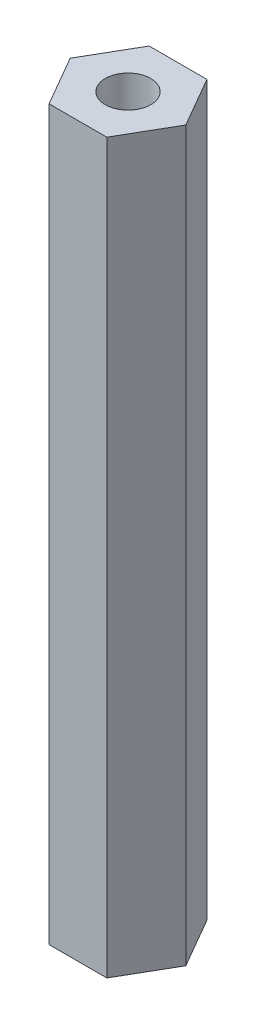
ISO-10303-21;
HEADER;
FILE_DESCRIPTION(('STEP AP214'),'2;1');
FILE_NAME('part.step','',(''),(''),'','','');
FILE_SCHEMA(('AUTOMOTIVE_DESIGN { 1 0 10303 214 1 1 1 1 }'));
ENDSEC;
DATA;
#1=APPLICATION_CONTEXT('core data for automotive mechanical design processes');
#2=APPLICATION_PROTOCOL_DEFINITION('international standard','automotive_design',2000,#1);
#3=PRODUCT_CONTEXT('',#1,'mechanical');
#4=PRODUCT('Part','Part','',(#3));
#5=PRODUCT_RELATED_PRODUCT_CATEGORY('part','',(#4));
#6=PRODUCT_DEFINITION_FORMATION('','',#4);
#7=PRODUCT_DEFINITION_CONTEXT('part definition',#1,'design');
#8=PRODUCT_DEFINITION('design','',#6,#7);
#9=PRODUCT_DEFINITION_SHAPE('','',#8);
#10=(LENGTH_UNIT() NAMED_UNIT(*) SI_UNIT(.MILLI.,.METRE.));
#11=(NAMED_UNIT(*) PLANE_ANGLE_UNIT() SI_UNIT($,.RADIAN.));
#12=(NAMED_UNIT(*) SI_UNIT($,.STERADIAN.) SOLID_ANGLE_UNIT());
#13=UNCERTAINTY_MEASURE_WITH_UNIT(LENGTH_MEASURE(1.E-05),#10,'distance_accuracy_value','');
#14=(GEOMETRIC_REPRESENTATION_CONTEXT(3) GLOBAL_UNCERTAINTY_ASSIGNED_CONTEXT((#13)) GLOBAL_UNIT_ASSIGNED_CONTEXT((#10,
#11,#12)) REPRESENTATION_CONTEXT('',''));
#15=CARTESIAN_POINT('',(0.,0.,0.));
#16=DIRECTION('',(0.,0.,1.));
#17=DIRECTION('',(1.,0.,0.));
#18=AXIS2_PLACEMENT_3D('',#15,#16,#17);
#19=CARTESIAN_POINT('',(1.58771324027148,20.,2.75));
#20=DIRECTION('',(-0.866025403784439,0.,-0.5));
#21=DIRECTION('',(-0.5,0.,0.866025403784439));
#22=AXIS2_PLACEMENT_3D('',#19,#20,#21);
#23=PLANE('',#22);
#24=DIRECTION('',(0.5,0.,-0.866025403784439));
#25=VECTOR('',#24,1.);
#26=CARTESIAN_POINT('',(1.58771324027148,-20.,2.75));
#27=LINE('',#26,#25);
#28=CARTESIAN_POINT('',(1.58771324027148,-20.,2.75));
#29=VERTEX_POINT('',#28);
#30=CARTESIAN_POINT('',(3.17542648054294,-20.,0.));
#31=VERTEX_POINT('',#30);
#32=EDGE_CURVE('E119',#29,#31,#27,.T.);
#33=ORIENTED_EDGE('',*,*,#32,.T.);
#34=DIRECTION('',(0.,-1.,0.));
#35=VECTOR('',#34,1.);
#36=CARTESIAN_POINT('',(3.17542648054294,20.,0.));
#37=LINE('',#36,#35);
#38=CARTESIAN_POINT('',(3.17542648054294,20.,0.));
#39=VERTEX_POINT('',#38);
#40=EDGE_CURVE('E11',#39,#31,#37,.T.);
#41=ORIENTED_EDGE('',*,*,#40,.F.);
#42=DIRECTION('',(0.5,0.,-0.866025403784439));
#43=VECTOR('',#42,1.);
#44=CARTESIAN_POINT('',(1.58771324027148,20.,2.75));
#45=LINE('',#44,#43);
#46=CARTESIAN_POINT('',(1.58771324027148,20.,2.75));
#47=VERTEX_POINT('',#46);
#48=EDGE_CURVE('E130',#47,#39,#45,.T.);
#49=ORIENTED_EDGE('',*,*,#48,.F.);
#50=DIRECTION('',(0.,-1.,0.));
#51=VECTOR('',#50,1.);
#52=CARTESIAN_POINT('',(1.58771324027148,20.,2.75));
#53=LINE('',#52,#51);
#54=EDGE_CURVE('E115',#47,#29,#53,.T.);
#55=ORIENTED_EDGE('',*,*,#54,.T.);
#56=EDGE_LOOP('',(#33,#41,#49,#55));
#57=FACE_BOUND('',#56,.T.);
#58=ADVANCED_FACE('F35',(#57),#23,.F.);
#59=CARTESIAN_POINT('',(3.17542648054294,20.,0.));
#60=DIRECTION('',(-0.866025403784439,0.,0.5));
#61=DIRECTION('',(0.5,0.,0.866025403784439));
#62=AXIS2_PLACEMENT_3D('',#59,#60,#61);
#63=PLANE('',#62);
#64=DIRECTION('',(-0.5,0.,-0.866025403784438));
#65=VECTOR('',#64,1.);
#66=CARTESIAN_POINT('',(3.17542648054294,-20.,0.));
#67=LINE('',#66,#65);
#68=CARTESIAN_POINT('',(1.58771324027146,-20.,-2.75));
#69=VERTEX_POINT('',#68);
#70=EDGE_CURVE('E122',#31,#69,#67,.T.);
#71=ORIENTED_EDGE('',*,*,#70,.T.);
#72=DIRECTION('',(0.,-1.,0.));
#73=VECTOR('',#72,1.);
#74=CARTESIAN_POINT('',(1.58771324027146,20.,-2.75));
#75=LINE('',#74,#73);
#76=CARTESIAN_POINT('',(1.58771324027146,20.,-2.75));
#77=VERTEX_POINT('',#76);
#78=EDGE_CURVE('E43',#77,#69,#75,.T.);
#79=ORIENTED_EDGE('',*,*,#78,.F.);
#80=DIRECTION('',(-0.5,0.,-0.866025403784438));
#81=VECTOR('',#80,1.);
#82=CARTESIAN_POINT('',(3.17542648054294,20.,0.));
#83=LINE('',#82,#81);
#84=EDGE_CURVE('E88',#39,#77,#83,.T.);
#85=ORIENTED_EDGE('',*,*,#84,.F.);
#86=ORIENTED_EDGE('',*,*,#40,.T.);
#87=EDGE_LOOP('',(#71,#79,#85,#86));
#88=FACE_BOUND('',#87,.T.);
#89=ADVANCED_FACE('F155',(#88),#63,.F.);
#90=CARTESIAN_POINT('',(1.58771324027146,20.,-2.75));
#91=DIRECTION('',(0.,0.,1.));
#92=DIRECTION('',(1.,0.,0.));
#93=AXIS2_PLACEMENT_3D('',#90,#91,#92);
#94=PLANE('',#93);
#95=DIRECTION('',(-1.,0.,0.));
#96=VECTOR('',#95,1.);
#97=CARTESIAN_POINT('',(1.58771324027146,-20.,-2.75));
#98=LINE('',#97,#96);
#99=CARTESIAN_POINT('',(-1.58771324027147,-20.,-2.75));
#100=VERTEX_POINT('',#99);
#101=EDGE_CURVE('E125',#69,#100,#98,.T.);
#102=ORIENTED_EDGE('',*,*,#101,.T.);
#103=DIRECTION('',(0.,-1.,0.));
#104=VECTOR('',#103,1.);
#105=CARTESIAN_POINT('',(-1.58771324027147,20.,-2.75));
#106=LINE('',#105,#104);
#107=CARTESIAN_POINT('',(-1.58771324027147,20.,-2.75));
#108=VERTEX_POINT('',#107);
#109=EDGE_CURVE('E110',#108,#100,#106,.T.);
#110=ORIENTED_EDGE('',*,*,#109,.F.);
#111=DIRECTION('',(-1.,0.,0.));
#112=VECTOR('',#111,1.);
#113=CARTESIAN_POINT('',(1.58771324027146,20.,-2.75));
#114=LINE('',#113,#112);
#115=EDGE_CURVE('E101',#77,#108,#114,.T.);
#116=ORIENTED_EDGE('',*,*,#115,.F.);
#117=ORIENTED_EDGE('',*,*,#78,.T.);
#118=EDGE_LOOP('',(#102,#110,#116,#117));
#119=FACE_BOUND('',#118,.T.);
#120=ADVANCED_FACE('F136',(#119),#94,.F.);
#121=CARTESIAN_POINT('',(-1.58771324027147,20.,-2.75));
#122=DIRECTION('',(0.866025403784439,0.,0.5));
#123=DIRECTION('',(0.5,0.,-0.866025403784439));
#124=AXIS2_PLACEMENT_3D('',#121,#122,#123);
#125=PLANE('',#124);
#126=DIRECTION('',(-0.5,0.,0.866025403784439));
#127=VECTOR('',#126,1.);
#128=CARTESIAN_POINT('',(-1.58771324027147,-20.,-2.75));
#129=LINE('',#128,#127);
#130=CARTESIAN_POINT('',(-3.17542648054294,-20.,0.));
#131=VERTEX_POINT('',#130);
#132=EDGE_CURVE('E109',#100,#131,#129,.T.);
#133=ORIENTED_EDGE('',*,*,#132,.T.);
#134=DIRECTION('',(0.,-1.,0.));
#135=VECTOR('',#134,1.);
#136=CARTESIAN_POINT('',(-3.17542648054294,20.,0.));
#137=LINE('',#136,#135);
#138=CARTESIAN_POINT('',(-3.17542648054294,20.,0.));
#139=VERTEX_POINT('',#138);
#140=EDGE_CURVE('E106',#139,#131,#137,.T.);
#141=ORIENTED_EDGE('',*,*,#140,.F.);
#142=DIRECTION('',(-0.5,0.,0.866025403784439));
#143=VECTOR('',#142,1.);
#144=CARTESIAN_POINT('',(-1.58771324027147,20.,-2.75));
#145=LINE('',#144,#143);
#146=EDGE_CURVE('E95',#108,#139,#145,.T.);
#147=ORIENTED_EDGE('',*,*,#146,.F.);
#148=ORIENTED_EDGE('',*,*,#109,.T.);
#149=EDGE_LOOP('',(#133,#141,#147,#148));
#150=FACE_BOUND('',#149,.T.);
#151=ADVANCED_FACE('F107',(#150),#125,.F.);
#152=CARTESIAN_POINT('',(-3.17542648054294,20.,0.));
#153=DIRECTION('',(0.866025403784438,0.,-0.5));
#154=DIRECTION('',(-0.5,0.,-0.866025403784438));
#155=AXIS2_PLACEMENT_3D('',#152,#153,#154);
#156=PLANE('',#155);
#157=DIRECTION('',(0.5,0.,0.866025403784438));
#158=VECTOR('',#157,1.);
#159=CARTESIAN_POINT('',(-3.17542648054294,-20.,0.));
#160=LINE('',#159,#158);
#161=CARTESIAN_POINT('',(-1.58771324027147,-20.,2.75));
#162=VERTEX_POINT('',#161);
#163=EDGE_CURVE('E74',#131,#162,#160,.T.);
#164=ORIENTED_EDGE('',*,*,#163,.T.);
#165=DIRECTION('',(0.,-1.,0.));
#166=VECTOR('',#165,1.);
#167=CARTESIAN_POINT('',(-1.58771324027147,20.,2.75));
#168=LINE('',#167,#166);
#169=CARTESIAN_POINT('',(-1.58771324027147,20.,2.75));
#170=VERTEX_POINT('',#169);
#171=EDGE_CURVE('E111',#170,#162,#168,.T.);
#172=ORIENTED_EDGE('',*,*,#171,.F.);
#173=DIRECTION('',(0.5,0.,0.866025403784438));
#174=VECTOR('',#173,1.);
#175=CARTESIAN_POINT('',(-3.17542648054294,20.,0.));
#176=LINE('',#175,#174);
#177=EDGE_CURVE('E99',#139,#170,#176,.T.);
#178=ORIENTED_EDGE('',*,*,#177,.F.);
#179=ORIENTED_EDGE('',*,*,#140,.T.);
#180=EDGE_LOOP('',(#164,#172,#178,#179));
#181=FACE_BOUND('',#180,.T.);
#182=ADVANCED_FACE('F113',(#181),#156,.F.);
#183=CARTESIAN_POINT('',(-1.58771324027147,20.,2.75));
#184=DIRECTION('',(0.,0.,-1.));
#185=DIRECTION('',(-1.,0.,0.));
#186=AXIS2_PLACEMENT_3D('',#183,#184,#185);
#187=PLANE('',#186);
#188=DIRECTION('',(1.,0.,0.));
#189=VECTOR('',#188,1.);
#190=CARTESIAN_POINT('',(-1.58771324027147,-20.,2.75));
#191=LINE('',#190,#189);
#192=EDGE_CURVE('E80',#162,#29,#191,.T.);
#193=ORIENTED_EDGE('',*,*,#192,.T.);
#194=ORIENTED_EDGE('',*,*,#54,.F.);
#195=DIRECTION('',(1.,0.,0.));
#196=VECTOR('',#195,1.);
#197=CARTESIAN_POINT('',(-1.58771324027147,20.,2.75));
#198=LINE('',#197,#196);
#199=EDGE_CURVE('E51',#170,#47,#198,.T.);
#200=ORIENTED_EDGE('',*,*,#199,.F.);
#201=ORIENTED_EDGE('',*,*,#171,.T.);
#202=EDGE_LOOP('',(#193,#194,#200,#201));
#203=FACE_BOUND('',#202,.T.);
#204=ADVANCED_FACE('F143',(#203),#187,.F.);
#205=CARTESIAN_POINT('',(0.,20.,0.));
#206=DIRECTION('',(0.,1.,0.));
#207=DIRECTION('',(0.,0.,1.));
#208=AXIS2_PLACEMENT_3D('',#205,#206,#207);
#209=PLANE('',#208);
#210=CARTESIAN_POINT('',(0.,20.,0.));
#211=DIRECTION('',(0.,1.,0.));
#212=DIRECTION('',(0.,0.,1.));
#213=AXIS2_PLACEMENT_3D('',#210,#211,#212);
#214=CIRCLE('',#213,1.24999999999999);
#215=CARTESIAN_POINT('',(0.,20.,1.24999999999999));
#216=VERTEX_POINT('',#215);
#217=EDGE_CURVE('E212',#216,#216,#214,.T.);
#218=ORIENTED_EDGE('',*,*,#217,.F.);
#219=EDGE_LOOP('',(#218));
#220=FACE_BOUND('',#219,.T.);
#221=ORIENTED_EDGE('',*,*,#48,.T.);
#222=ORIENTED_EDGE('',*,*,#84,.T.);
#223=ORIENTED_EDGE('',*,*,#115,.T.);
#224=ORIENTED_EDGE('',*,*,#146,.T.);
#225=ORIENTED_EDGE('',*,*,#177,.T.);
#226=ORIENTED_EDGE('',*,*,#199,.T.);
#227=EDGE_LOOP('',(#221,#222,#223,#224,#225,#226));
#228=FACE_BOUND('',#227,.T.);
#229=ADVANCED_FACE('F97',(#220,#228),#209,.T.);
#230=CARTESIAN_POINT('',(0.,-20.,0.));
#231=DIRECTION('',(0.,1.,0.));
#232=DIRECTION('',(0.,0.,1.));
#233=AXIS2_PLACEMENT_3D('',#230,#231,#232);
#234=PLANE('',#233);
#235=CARTESIAN_POINT('',(0.,-20.,0.));
#236=DIRECTION('',(0.,1.,0.));
#237=DIRECTION('',(0.,0.,1.));
#238=AXIS2_PLACEMENT_3D('',#235,#236,#237);
#239=CIRCLE('',#238,1.24999999999998);
#240=CARTESIAN_POINT('',(0.,-20.,1.24999999999998));
#241=VERTEX_POINT('',#240);
#242=EDGE_CURVE('E123',#241,#241,#239,.T.);
#243=ORIENTED_EDGE('',*,*,#242,.T.);
#244=EDGE_LOOP('',(#243));
#245=FACE_BOUND('',#244,.T.);
#246=ORIENTED_EDGE('',*,*,#32,.F.);
#247=ORIENTED_EDGE('',*,*,#192,.F.);
#248=ORIENTED_EDGE('',*,*,#163,.F.);
#249=ORIENTED_EDGE('',*,*,#132,.F.);
#250=ORIENTED_EDGE('',*,*,#101,.F.);
#251=ORIENTED_EDGE('',*,*,#70,.F.);
#252=EDGE_LOOP('',(#246,#247,#248,#249,#250,#251));
#253=FACE_BOUND('',#252,.T.);
#254=ADVANCED_FACE('F139',(#245,#253),#234,.F.);
#255=CARTESIAN_POINT('',(0.,20.,0.));
#256=DIRECTION('',(0.,1.,0.));
#257=DIRECTION('',(0.,0.,1.));
#258=AXIS2_PLACEMENT_3D('',#255,#256,#257);
#259=CYLINDRICAL_SURFACE('',#258,1.24999999999999);
#260=ORIENTED_EDGE('',*,*,#242,.F.);
#261=EDGE_LOOP('',(#260));
#262=FACE_BOUND('',#261,.T.);
#263=ORIENTED_EDGE('',*,*,#217,.T.);
#264=EDGE_LOOP('',(#263));
#265=FACE_BOUND('',#264,.T.);
#266=ADVANCED_FACE('F192',(#262,#265),#259,.F.);
#267=CLOSED_SHELL('',(#58,#89,#120,#151,#182,#204,#229,#254,#266));
#268=MANIFOLD_SOLID_BREP('B2',#267);
#269=ADVANCED_BREP_SHAPE_REPRESENTATION('',(#18,#268),#14);
#270=SHAPE_DEFINITION_REPRESENTATION(#9,#269);
ENDSEC;
END-ISO-10303-21;
